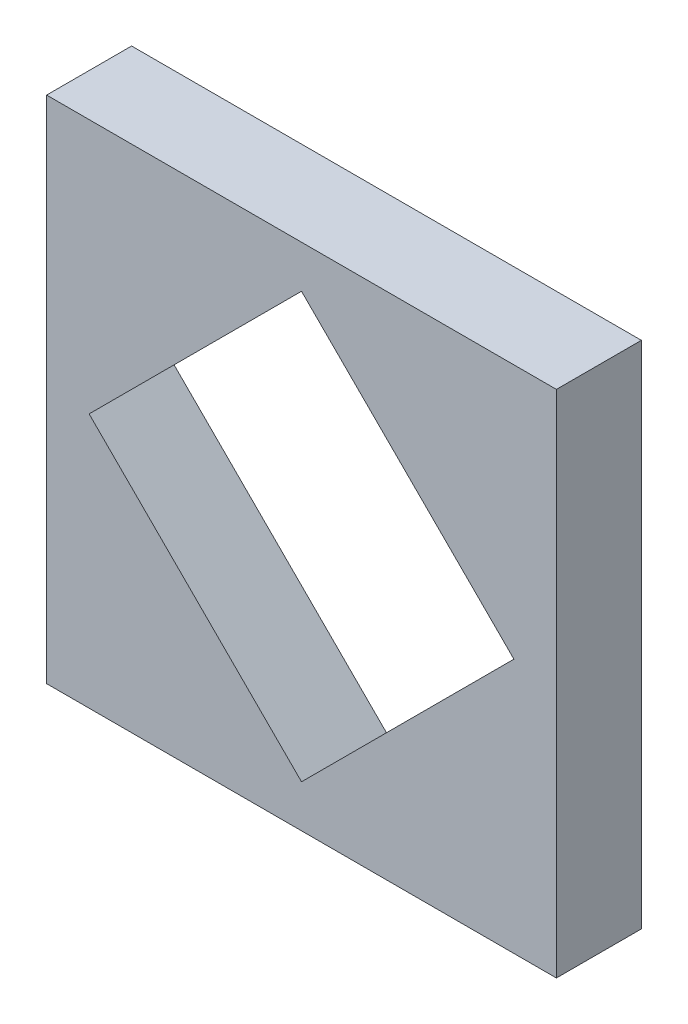
ISO-10303-21;
HEADER;
FILE_DESCRIPTION(('STEP AP214'),'2;1');
FILE_NAME('part.step','',(''),(''),'','','');
FILE_SCHEMA(('AUTOMOTIVE_DESIGN { 1 0 10303 214 1 1 1 1 }'));
ENDSEC;
DATA;
#1=APPLICATION_CONTEXT('core data for automotive mechanical design processes');
#2=APPLICATION_PROTOCOL_DEFINITION('international standard','automotive_design',2000,#1);
#3=PRODUCT_CONTEXT('',#1,'mechanical');
#4=PRODUCT('Part','Part','',(#3));
#5=PRODUCT_RELATED_PRODUCT_CATEGORY('part','',(#4));
#6=PRODUCT_DEFINITION_FORMATION('','',#4);
#7=PRODUCT_DEFINITION_CONTEXT('part definition',#1,'design');
#8=PRODUCT_DEFINITION('design','',#6,#7);
#9=PRODUCT_DEFINITION_SHAPE('','',#8);
#10=(LENGTH_UNIT() NAMED_UNIT(*) SI_UNIT(.MILLI.,.METRE.));
#11=(NAMED_UNIT(*) PLANE_ANGLE_UNIT() SI_UNIT($,.RADIAN.));
#12=(NAMED_UNIT(*) SI_UNIT($,.STERADIAN.) SOLID_ANGLE_UNIT());
#13=UNCERTAINTY_MEASURE_WITH_UNIT(LENGTH_MEASURE(1.E-05),#10,'distance_accuracy_value','');
#14=(GEOMETRIC_REPRESENTATION_CONTEXT(3) GLOBAL_UNCERTAINTY_ASSIGNED_CONTEXT((#13)) GLOBAL_UNIT_ASSIGNED_CONTEXT((#10,
#11,#12)) REPRESENTATION_CONTEXT('',''));
#15=CARTESIAN_POINT('',(0.,0.,0.));
#16=DIRECTION('',(0.,0.,1.));
#17=DIRECTION('',(1.,0.,0.));
#18=AXIS2_PLACEMENT_3D('',#15,#16,#17);
#19=CARTESIAN_POINT('',(0.,0.,10.));
#20=DIRECTION('',(0.,0.,1.));
#21=DIRECTION('',(1.,0.,0.));
#22=AXIS2_PLACEMENT_3D('',#19,#20,#21);
#23=PLANE('',#22);
#24=DIRECTION('',(0.,-1.,0.));
#25=VECTOR('',#24,1.);
#26=CARTESIAN_POINT('',(-30.,30.,10.));
#27=LINE('',#26,#25);
#28=CARTESIAN_POINT('',(-30.,30.,10.));
#29=VERTEX_POINT('',#28);
#30=CARTESIAN_POINT('',(-30.,-30.,10.));
#31=VERTEX_POINT('',#30);
#32=EDGE_CURVE('E158',#29,#31,#27,.T.);
#33=ORIENTED_EDGE('',*,*,#32,.T.);
#34=DIRECTION('',(1.,0.,0.));
#35=VECTOR('',#34,1.);
#36=CARTESIAN_POINT('',(-30.,-30.,10.));
#37=LINE('',#36,#35);
#38=CARTESIAN_POINT('',(30.,-30.,10.));
#39=VERTEX_POINT('',#38);
#40=EDGE_CURVE('E161',#31,#39,#37,.T.);
#41=ORIENTED_EDGE('',*,*,#40,.T.);
#42=DIRECTION('',(0.,-1.,0.));
#43=VECTOR('',#42,1.);
#44=CARTESIAN_POINT('',(30.,30.,10.));
#45=LINE('',#44,#43);
#46=CARTESIAN_POINT('',(30.,30.,10.));
#47=VERTEX_POINT('',#46);
#48=EDGE_CURVE('E164',#47,#39,#45,.T.);
#49=ORIENTED_EDGE('',*,*,#48,.F.);
#50=DIRECTION('',(1.,0.,0.));
#51=VECTOR('',#50,1.);
#52=CARTESIAN_POINT('',(-30.,30.,10.));
#53=LINE('',#52,#51);
#54=EDGE_CURVE('E167',#29,#47,#53,.T.);
#55=ORIENTED_EDGE('',*,*,#54,.F.);
#56=EDGE_LOOP('',(#33,#41,#49,#55));
#57=FACE_BOUND('',#56,.T.);
#58=DIRECTION('',(-0.707106781186547,0.707106781186547,0.));
#59=VECTOR('',#58,1.);
#60=CARTESIAN_POINT('',(25.,0.,10.));
#61=LINE('',#60,#59);
#62=CARTESIAN_POINT('',(25.,0.,10.));
#63=VERTEX_POINT('',#62);
#64=CARTESIAN_POINT('',(0.,25.,10.));
#65=VERTEX_POINT('',#64);
#66=EDGE_CURVE('E130',#63,#65,#61,.T.);
#67=ORIENTED_EDGE('',*,*,#66,.F.);
#68=DIRECTION('',(0.707106781186547,0.707106781186548,0.));
#69=VECTOR('',#68,1.);
#70=CARTESIAN_POINT('',(0.,-25.,10.));
#71=LINE('',#70,#69);
#72=CARTESIAN_POINT('',(0.,-25.,10.));
#73=VERTEX_POINT('',#72);
#74=EDGE_CURVE('E122',#73,#63,#71,.T.);
#75=ORIENTED_EDGE('',*,*,#74,.F.);
#76=DIRECTION('',(0.707106781186548,-0.707106781186547,0.));
#77=VECTOR('',#76,1.);
#78=CARTESIAN_POINT('',(-25.,0.,10.));
#79=LINE('',#78,#77);
#80=CARTESIAN_POINT('',(-25.,0.,10.));
#81=VERTEX_POINT('',#80);
#82=EDGE_CURVE('E144',#81,#73,#79,.T.);
#83=ORIENTED_EDGE('',*,*,#82,.F.);
#84=DIRECTION('',(-0.707106781186547,-0.707106781186548,0.));
#85=VECTOR('',#84,1.);
#86=CARTESIAN_POINT('',(0.,25.,10.));
#87=LINE('',#86,#85);
#88=EDGE_CURVE('E142',#65,#81,#87,.T.);
#89=ORIENTED_EDGE('',*,*,#88,.F.);
#90=EDGE_LOOP('',(#67,#75,#83,#89));
#91=FACE_BOUND('',#90,.T.);
#92=ADVANCED_FACE('F57',(#57,#91),#23,.T.);
#93=CARTESIAN_POINT('',(0.,0.,0.));
#94=DIRECTION('',(0.,0.,1.));
#95=DIRECTION('',(1.,0.,0.));
#96=AXIS2_PLACEMENT_3D('',#93,#94,#95);
#97=PLANE('',#96);
#98=DIRECTION('',(0.,-1.,0.));
#99=VECTOR('',#98,1.);
#100=CARTESIAN_POINT('',(-30.,30.,0.));
#101=LINE('',#100,#99);
#102=CARTESIAN_POINT('',(-30.,30.,0.));
#103=VERTEX_POINT('',#102);
#104=CARTESIAN_POINT('',(-30.,-30.,0.));
#105=VERTEX_POINT('',#104);
#106=EDGE_CURVE('E138',#103,#105,#101,.T.);
#107=ORIENTED_EDGE('',*,*,#106,.F.);
#108=DIRECTION('',(1.,0.,0.));
#109=VECTOR('',#108,1.);
#110=CARTESIAN_POINT('',(-30.,30.,0.));
#111=LINE('',#110,#109);
#112=CARTESIAN_POINT('',(30.,30.,0.));
#113=VERTEX_POINT('',#112);
#114=EDGE_CURVE('E162',#103,#113,#111,.T.);
#115=ORIENTED_EDGE('',*,*,#114,.T.);
#116=DIRECTION('',(0.,-1.,0.));
#117=VECTOR('',#116,1.);
#118=CARTESIAN_POINT('',(30.,30.,0.));
#119=LINE('',#118,#117);
#120=CARTESIAN_POINT('',(30.,-30.,0.));
#121=VERTEX_POINT('',#120);
#122=EDGE_CURVE('E176',#113,#121,#119,.T.);
#123=ORIENTED_EDGE('',*,*,#122,.T.);
#124=DIRECTION('',(1.,0.,0.));
#125=VECTOR('',#124,1.);
#126=CARTESIAN_POINT('',(-30.,-30.,0.));
#127=LINE('',#126,#125);
#128=EDGE_CURVE('E173',#105,#121,#127,.T.);
#129=ORIENTED_EDGE('',*,*,#128,.F.);
#130=EDGE_LOOP('',(#107,#115,#123,#129));
#131=FACE_BOUND('',#130,.T.);
#132=DIRECTION('',(0.707106781186547,0.707106781186548,0.));
#133=VECTOR('',#132,1.);
#134=CARTESIAN_POINT('',(0.,-25.,0.));
#135=LINE('',#134,#133);
#136=CARTESIAN_POINT('',(0.,-25.,0.));
#137=VERTEX_POINT('',#136);
#138=CARTESIAN_POINT('',(25.,0.,0.));
#139=VERTEX_POINT('',#138);
#140=EDGE_CURVE('E80',#137,#139,#135,.T.);
#141=ORIENTED_EDGE('',*,*,#140,.T.);
#142=DIRECTION('',(-0.707106781186547,0.707106781186547,0.));
#143=VECTOR('',#142,1.);
#144=CARTESIAN_POINT('',(25.,0.,0.));
#145=LINE('',#144,#143);
#146=CARTESIAN_POINT('',(0.,25.,0.));
#147=VERTEX_POINT('',#146);
#148=EDGE_CURVE('E137',#139,#147,#145,.T.);
#149=ORIENTED_EDGE('',*,*,#148,.T.);
#150=DIRECTION('',(-0.707106781186547,-0.707106781186548,0.));
#151=VECTOR('',#150,1.);
#152=CARTESIAN_POINT('',(0.,25.,0.));
#153=LINE('',#152,#151);
#154=CARTESIAN_POINT('',(-25.,0.,0.));
#155=VERTEX_POINT('',#154);
#156=EDGE_CURVE('E150',#147,#155,#153,.T.);
#157=ORIENTED_EDGE('',*,*,#156,.T.);
#158=DIRECTION('',(0.707106781186548,-0.707106781186547,0.));
#159=VECTOR('',#158,1.);
#160=CARTESIAN_POINT('',(-25.,0.,0.));
#161=LINE('',#160,#159);
#162=EDGE_CURVE('E131',#155,#137,#161,.T.);
#163=ORIENTED_EDGE('',*,*,#162,.T.);
#164=EDGE_LOOP('',(#141,#149,#157,#163));
#165=FACE_BOUND('',#164,.T.);
#166=ADVANCED_FACE('F193',(#131,#165),#97,.F.);
#167=CARTESIAN_POINT('',(-30.,30.,10.));
#168=DIRECTION('',(1.,0.,0.));
#169=DIRECTION('',(0.,1.,0.));
#170=AXIS2_PLACEMENT_3D('',#167,#168,#169);
#171=PLANE('',#170);
#172=ORIENTED_EDGE('',*,*,#106,.T.);
#173=DIRECTION('',(0.,0.,-1.));
#174=VECTOR('',#173,1.);
#175=CARTESIAN_POINT('',(-30.,-30.,10.));
#176=LINE('',#175,#174);
#177=EDGE_CURVE('E12',#31,#105,#176,.T.);
#178=ORIENTED_EDGE('',*,*,#177,.F.);
#179=ORIENTED_EDGE('',*,*,#32,.F.);
#180=DIRECTION('',(0.,0.,-1.));
#181=VECTOR('',#180,1.);
#182=CARTESIAN_POINT('',(-30.,30.,10.));
#183=LINE('',#182,#181);
#184=EDGE_CURVE('E170',#29,#103,#183,.T.);
#185=ORIENTED_EDGE('',*,*,#184,.T.);
#186=EDGE_LOOP('',(#172,#178,#179,#185));
#187=FACE_BOUND('',#186,.T.);
#188=ADVANCED_FACE('F59',(#187),#171,.F.);
#189=CARTESIAN_POINT('',(-30.,-30.,10.));
#190=DIRECTION('',(0.,1.,0.));
#191=DIRECTION('',(0.,0.,1.));
#192=AXIS2_PLACEMENT_3D('',#189,#190,#191);
#193=PLANE('',#192);
#194=ORIENTED_EDGE('',*,*,#128,.T.);
#195=DIRECTION('',(0.,0.,-1.));
#196=VECTOR('',#195,1.);
#197=CARTESIAN_POINT('',(30.,-30.,10.));
#198=LINE('',#197,#196);
#199=EDGE_CURVE('E65',#39,#121,#198,.T.);
#200=ORIENTED_EDGE('',*,*,#199,.F.);
#201=ORIENTED_EDGE('',*,*,#40,.F.);
#202=ORIENTED_EDGE('',*,*,#177,.T.);
#203=EDGE_LOOP('',(#194,#200,#201,#202));
#204=FACE_BOUND('',#203,.T.);
#205=ADVANCED_FACE('F189',(#204),#193,.F.);
#206=CARTESIAN_POINT('',(30.,30.,10.));
#207=DIRECTION('',(1.,0.,0.));
#208=DIRECTION('',(0.,0.,-1.));
#209=AXIS2_PLACEMENT_3D('',#206,#207,#208);
#210=PLANE('',#209);
#211=ORIENTED_EDGE('',*,*,#122,.F.);
#212=DIRECTION('',(0.,0.,-1.));
#213=VECTOR('',#212,1.);
#214=CARTESIAN_POINT('',(30.,30.,10.));
#215=LINE('',#214,#213);
#216=EDGE_CURVE('E182',#47,#113,#215,.T.);
#217=ORIENTED_EDGE('',*,*,#216,.F.);
#218=ORIENTED_EDGE('',*,*,#48,.T.);
#219=ORIENTED_EDGE('',*,*,#199,.T.);
#220=EDGE_LOOP('',(#211,#217,#218,#219));
#221=FACE_BOUND('',#220,.T.);
#222=ADVANCED_FACE('F186',(#221),#210,.T.);
#223=CARTESIAN_POINT('',(-30.,30.,10.));
#224=DIRECTION('',(0.,1.,0.));
#225=DIRECTION('',(0.,0.,1.));
#226=AXIS2_PLACEMENT_3D('',#223,#224,#225);
#227=PLANE('',#226);
#228=ORIENTED_EDGE('',*,*,#114,.F.);
#229=ORIENTED_EDGE('',*,*,#184,.F.);
#230=ORIENTED_EDGE('',*,*,#54,.T.);
#231=ORIENTED_EDGE('',*,*,#216,.T.);
#232=EDGE_LOOP('',(#228,#229,#230,#231));
#233=FACE_BOUND('',#232,.T.);
#234=ADVANCED_FACE('F197',(#233),#227,.T.);
#235=CARTESIAN_POINT('',(0.,-25.,10.));
#236=DIRECTION('',(-0.707106781186548,0.707106781186547,0.));
#237=DIRECTION('',(-0.707106781186547,-0.707106781186548,0.));
#238=AXIS2_PLACEMENT_3D('',#235,#236,#237);
#239=PLANE('',#238);
#240=ORIENTED_EDGE('',*,*,#140,.F.);
#241=DIRECTION('',(0.,0.,-1.));
#242=VECTOR('',#241,1.);
#243=CARTESIAN_POINT('',(0.,-25.,10.));
#244=LINE('',#243,#242);
#245=EDGE_CURVE('E126',#73,#137,#244,.T.);
#246=ORIENTED_EDGE('',*,*,#245,.F.);
#247=ORIENTED_EDGE('',*,*,#74,.T.);
#248=DIRECTION('',(0.,0.,-1.));
#249=VECTOR('',#248,1.);
#250=CARTESIAN_POINT('',(25.,0.,10.));
#251=LINE('',#250,#249);
#252=EDGE_CURVE('E125',#63,#139,#251,.T.);
#253=ORIENTED_EDGE('',*,*,#252,.T.);
#254=EDGE_LOOP('',(#240,#246,#247,#253));
#255=FACE_BOUND('',#254,.T.);
#256=ADVANCED_FACE('F124',(#255),#239,.T.);
#257=CARTESIAN_POINT('',(25.,0.,10.));
#258=DIRECTION('',(-0.707106781186548,-0.707106781186548,0.));
#259=DIRECTION('',(0.707106781186548,-0.707106781186548,0.));
#260=AXIS2_PLACEMENT_3D('',#257,#258,#259);
#261=PLANE('',#260);
#262=ORIENTED_EDGE('',*,*,#148,.F.);
#263=ORIENTED_EDGE('',*,*,#252,.F.);
#264=ORIENTED_EDGE('',*,*,#66,.T.);
#265=DIRECTION('',(0.,0.,-1.));
#266=VECTOR('',#265,1.);
#267=CARTESIAN_POINT('',(0.,25.,10.));
#268=LINE('',#267,#266);
#269=EDGE_CURVE('E139',#65,#147,#268,.T.);
#270=ORIENTED_EDGE('',*,*,#269,.T.);
#271=EDGE_LOOP('',(#262,#263,#264,#270));
#272=FACE_BOUND('',#271,.T.);
#273=ADVANCED_FACE('F134',(#272),#261,.T.);
#274=CARTESIAN_POINT('',(0.,25.,10.));
#275=DIRECTION('',(0.707106781186548,-0.707106781186547,0.));
#276=DIRECTION('',(0.707106781186547,0.707106781186548,0.));
#277=AXIS2_PLACEMENT_3D('',#274,#275,#276);
#278=PLANE('',#277);
#279=ORIENTED_EDGE('',*,*,#156,.F.);
#280=ORIENTED_EDGE('',*,*,#269,.F.);
#281=ORIENTED_EDGE('',*,*,#88,.T.);
#282=DIRECTION('',(0.,0.,-1.));
#283=VECTOR('',#282,1.);
#284=CARTESIAN_POINT('',(-25.,0.,10.));
#285=LINE('',#284,#283);
#286=EDGE_CURVE('E72',#81,#155,#285,.T.);
#287=ORIENTED_EDGE('',*,*,#286,.T.);
#288=EDGE_LOOP('',(#279,#280,#281,#287));
#289=FACE_BOUND('',#288,.T.);
#290=ADVANCED_FACE('F237',(#289),#278,.T.);
#291=CARTESIAN_POINT('',(-25.,0.,10.));
#292=DIRECTION('',(0.707106781186547,0.707106781186548,0.));
#293=DIRECTION('',(-0.707106781186548,0.707106781186547,0.));
#294=AXIS2_PLACEMENT_3D('',#291,#292,#293);
#295=PLANE('',#294);
#296=ORIENTED_EDGE('',*,*,#162,.F.);
#297=ORIENTED_EDGE('',*,*,#286,.F.);
#298=ORIENTED_EDGE('',*,*,#82,.T.);
#299=ORIENTED_EDGE('',*,*,#245,.T.);
#300=EDGE_LOOP('',(#296,#297,#298,#299));
#301=FACE_BOUND('',#300,.T.);
#302=ADVANCED_FACE('F243',(#301),#295,.T.);
#303=CLOSED_SHELL('',(#92,#166,#188,#205,#222,#234,#256,#273,#290,#302));
#304=MANIFOLD_SOLID_BREP('B2',#303);
#305=ADVANCED_BREP_SHAPE_REPRESENTATION('',(#18,#304),#14);
#306=SHAPE_DEFINITION_REPRESENTATION(#9,#305);
ENDSEC;
END-ISO-10303-21;
